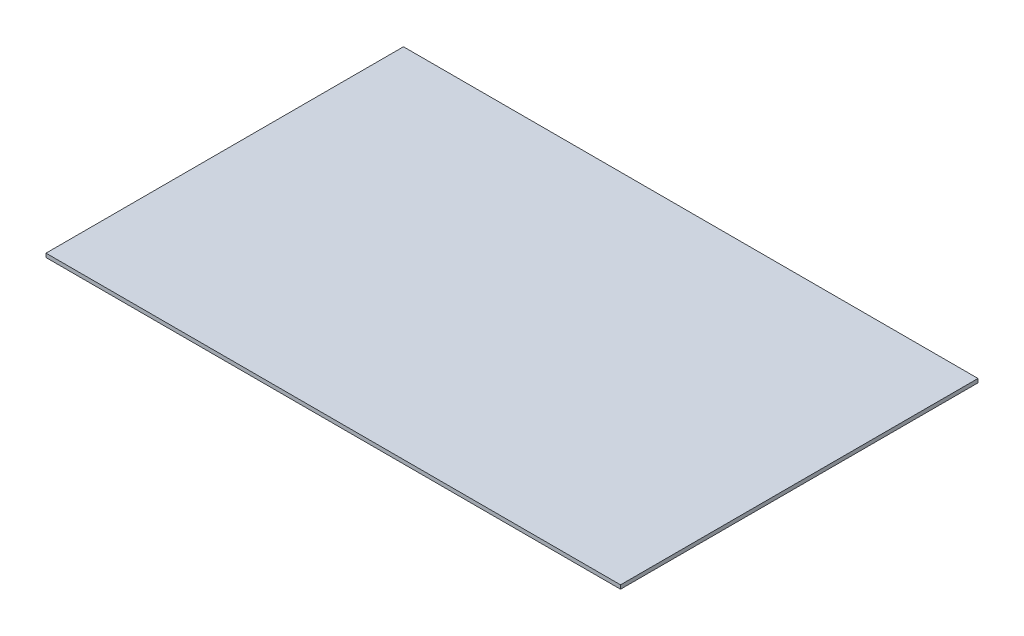
ISO-10303-21;
HEADER;
FILE_DESCRIPTION(('STEP AP214'),'2;1');
FILE_NAME('part.step','',(''),(''),'','','');
FILE_SCHEMA(('AUTOMOTIVE_DESIGN { 1 0 10303 214 1 1 1 1 }'));
ENDSEC;
DATA;
#1=APPLICATION_CONTEXT('core data for automotive mechanical design processes');
#2=APPLICATION_PROTOCOL_DEFINITION('international standard','automotive_design',2000,#1);
#3=PRODUCT_CONTEXT('',#1,'mechanical');
#4=PRODUCT('Part','Part','',(#3));
#5=PRODUCT_RELATED_PRODUCT_CATEGORY('part','',(#4));
#6=PRODUCT_DEFINITION_FORMATION('','',#4);
#7=PRODUCT_DEFINITION_CONTEXT('part definition',#1,'design');
#8=PRODUCT_DEFINITION('design','',#6,#7);
#9=PRODUCT_DEFINITION_SHAPE('','',#8);
#10=(LENGTH_UNIT() NAMED_UNIT(*) SI_UNIT(.MILLI.,.METRE.));
#11=(NAMED_UNIT(*) PLANE_ANGLE_UNIT() SI_UNIT($,.RADIAN.));
#12=(NAMED_UNIT(*) SI_UNIT($,.STERADIAN.) SOLID_ANGLE_UNIT());
#13=UNCERTAINTY_MEASURE_WITH_UNIT(LENGTH_MEASURE(1.E-05),#10,'distance_accuracy_value','');
#14=(GEOMETRIC_REPRESENTATION_CONTEXT(3) GLOBAL_UNCERTAINTY_ASSIGNED_CONTEXT((#13)) GLOBAL_UNIT_ASSIGNED_CONTEXT((#10,
#11,#12)) REPRESENTATION_CONTEXT('',''));
#15=CARTESIAN_POINT('',(0.,0.,0.));
#16=DIRECTION('',(0.,0.,1.));
#17=DIRECTION('',(1.,0.,0.));
#18=AXIS2_PLACEMENT_3D('',#15,#16,#17);
#19=CARTESIAN_POINT('',(225.,3.,140.));
#20=DIRECTION('',(-1.,0.,0.));
#21=DIRECTION('',(0.,0.,1.));
#22=AXIS2_PLACEMENT_3D('',#19,#20,#21);
#23=PLANE('',#22);
#24=DIRECTION('',(0.,0.,-1.));
#25=VECTOR('',#24,1.);
#26=CARTESIAN_POINT('',(225.,0.,140.));
#27=LINE('',#26,#25);
#28=CARTESIAN_POINT('',(225.,0.,140.));
#29=VERTEX_POINT('',#28);
#30=CARTESIAN_POINT('',(225.,0.,-140.));
#31=VERTEX_POINT('',#30);
#32=EDGE_CURVE('E96',#29,#31,#27,.T.);
#33=ORIENTED_EDGE('',*,*,#32,.T.);
#34=DIRECTION('',(0.,-1.,0.));
#35=VECTOR('',#34,1.);
#36=CARTESIAN_POINT('',(225.,3.,-140.));
#37=LINE('',#36,#35);
#38=CARTESIAN_POINT('',(225.,3.,-140.));
#39=VERTEX_POINT('',#38);
#40=EDGE_CURVE('E11',#39,#31,#37,.T.);
#41=ORIENTED_EDGE('',*,*,#40,.F.);
#42=DIRECTION('',(0.,0.,-1.));
#43=VECTOR('',#42,1.);
#44=CARTESIAN_POINT('',(225.,3.,140.));
#45=LINE('',#44,#43);
#46=CARTESIAN_POINT('',(225.,3.,140.));
#47=VERTEX_POINT('',#46);
#48=EDGE_CURVE('E84',#47,#39,#45,.T.);
#49=ORIENTED_EDGE('',*,*,#48,.F.);
#50=DIRECTION('',(0.,-1.,0.));
#51=VECTOR('',#50,1.);
#52=CARTESIAN_POINT('',(225.,3.,140.));
#53=LINE('',#52,#51);
#54=EDGE_CURVE('E92',#47,#29,#53,.T.);
#55=ORIENTED_EDGE('',*,*,#54,.T.);
#56=EDGE_LOOP('',(#33,#41,#49,#55));
#57=FACE_BOUND('',#56,.T.);
#58=ADVANCED_FACE('F33',(#57),#23,.F.);
#59=CARTESIAN_POINT('',(-225.,3.,-140.));
#60=DIRECTION('',(0.,0.,1.));
#61=DIRECTION('',(1.,0.,0.));
#62=AXIS2_PLACEMENT_3D('',#59,#60,#61);
#63=PLANE('',#62);
#64=DIRECTION('',(-1.,0.,0.));
#65=VECTOR('',#64,1.);
#66=CARTESIAN_POINT('',(-225.,0.,-140.));
#67=LINE('',#66,#65);
#68=CARTESIAN_POINT('',(-225.,0.,-140.));
#69=VERTEX_POINT('',#68);
#70=EDGE_CURVE('E88',#31,#69,#67,.T.);
#71=ORIENTED_EDGE('',*,*,#70,.T.);
#72=DIRECTION('',(0.,-1.,0.));
#73=VECTOR('',#72,1.);
#74=CARTESIAN_POINT('',(-225.,3.,-140.));
#75=LINE('',#74,#73);
#76=CARTESIAN_POINT('',(-225.,3.,-140.));
#77=VERTEX_POINT('',#76);
#78=EDGE_CURVE('E41',#77,#69,#75,.T.);
#79=ORIENTED_EDGE('',*,*,#78,.F.);
#80=DIRECTION('',(-1.,0.,0.));
#81=VECTOR('',#80,1.);
#82=CARTESIAN_POINT('',(-225.,3.,-140.));
#83=LINE('',#82,#81);
#84=EDGE_CURVE('E79',#39,#77,#83,.T.);
#85=ORIENTED_EDGE('',*,*,#84,.F.);
#86=ORIENTED_EDGE('',*,*,#40,.T.);
#87=EDGE_LOOP('',(#71,#79,#85,#86));
#88=FACE_BOUND('',#87,.T.);
#89=ADVANCED_FACE('F87',(#88),#63,.F.);
#90=CARTESIAN_POINT('',(-225.,3.,140.));
#91=DIRECTION('',(1.,0.,0.));
#92=DIRECTION('',(0.,0.,-1.));
#93=AXIS2_PLACEMENT_3D('',#90,#91,#92);
#94=PLANE('',#93);
#95=DIRECTION('',(0.,0.,1.));
#96=VECTOR('',#95,1.);
#97=CARTESIAN_POINT('',(-225.,0.,140.));
#98=LINE('',#97,#96);
#99=CARTESIAN_POINT('',(-225.,0.,140.));
#100=VERTEX_POINT('',#99);
#101=EDGE_CURVE('E66',#69,#100,#98,.T.);
#102=ORIENTED_EDGE('',*,*,#101,.T.);
#103=DIRECTION('',(0.,-1.,0.));
#104=VECTOR('',#103,1.);
#105=CARTESIAN_POINT('',(-225.,3.,140.));
#106=LINE('',#105,#104);
#107=CARTESIAN_POINT('',(-225.,3.,140.));
#108=VERTEX_POINT('',#107);
#109=EDGE_CURVE('E89',#108,#100,#106,.T.);
#110=ORIENTED_EDGE('',*,*,#109,.F.);
#111=DIRECTION('',(0.,0.,1.));
#112=VECTOR('',#111,1.);
#113=CARTESIAN_POINT('',(-225.,3.,140.));
#114=LINE('',#113,#112);
#115=EDGE_CURVE('E82',#77,#108,#114,.T.);
#116=ORIENTED_EDGE('',*,*,#115,.F.);
#117=ORIENTED_EDGE('',*,*,#78,.T.);
#118=EDGE_LOOP('',(#102,#110,#116,#117));
#119=FACE_BOUND('',#118,.T.);
#120=ADVANCED_FACE('F90',(#119),#94,.F.);
#121=CARTESIAN_POINT('',(-225.,3.,140.));
#122=DIRECTION('',(0.,0.,-1.));
#123=DIRECTION('',(-1.,0.,0.));
#124=AXIS2_PLACEMENT_3D('',#121,#122,#123);
#125=PLANE('',#124);
#126=DIRECTION('',(1.,0.,0.));
#127=VECTOR('',#126,1.);
#128=CARTESIAN_POINT('',(-225.,0.,140.));
#129=LINE('',#128,#127);
#130=EDGE_CURVE('E72',#100,#29,#129,.T.);
#131=ORIENTED_EDGE('',*,*,#130,.T.);
#132=ORIENTED_EDGE('',*,*,#54,.F.);
#133=DIRECTION('',(1.,0.,0.));
#134=VECTOR('',#133,1.);
#135=CARTESIAN_POINT('',(-225.,3.,140.));
#136=LINE('',#135,#134);
#137=EDGE_CURVE('E49',#108,#47,#136,.T.);
#138=ORIENTED_EDGE('',*,*,#137,.F.);
#139=ORIENTED_EDGE('',*,*,#109,.T.);
#140=EDGE_LOOP('',(#131,#132,#138,#139));
#141=FACE_BOUND('',#140,.T.);
#142=ADVANCED_FACE('F103',(#141),#125,.F.);
#143=CARTESIAN_POINT('',(0.,3.,0.));
#144=DIRECTION('',(0.,-1.,0.));
#145=DIRECTION('',(0.,0.,-1.));
#146=AXIS2_PLACEMENT_3D('',#143,#144,#145);
#147=PLANE('',#146);
#148=ORIENTED_EDGE('',*,*,#48,.T.);
#149=ORIENTED_EDGE('',*,*,#84,.T.);
#150=ORIENTED_EDGE('',*,*,#115,.T.);
#151=ORIENTED_EDGE('',*,*,#137,.T.);
#152=EDGE_LOOP('',(#148,#149,#150,#151));
#153=FACE_BOUND('',#152,.T.);
#154=ADVANCED_FACE('F80',(#153),#147,.F.);
#155=CARTESIAN_POINT('',(0.,0.,0.));
#156=DIRECTION('',(0.,-1.,0.));
#157=DIRECTION('',(0.,0.,-1.));
#158=AXIS2_PLACEMENT_3D('',#155,#156,#157);
#159=PLANE('',#158);
#160=ORIENTED_EDGE('',*,*,#32,.F.);
#161=ORIENTED_EDGE('',*,*,#130,.F.);
#162=ORIENTED_EDGE('',*,*,#101,.F.);
#163=ORIENTED_EDGE('',*,*,#70,.F.);
#164=EDGE_LOOP('',(#160,#161,#162,#163));
#165=FACE_BOUND('',#164,.T.);
#166=ADVANCED_FACE('F106',(#165),#159,.T.);
#167=CLOSED_SHELL('',(#58,#89,#120,#142,#154,#166));
#168=MANIFOLD_SOLID_BREP('B2',#167);
#169=ADVANCED_BREP_SHAPE_REPRESENTATION('',(#18,#168),#14);
#170=SHAPE_DEFINITION_REPRESENTATION(#9,#169);
ENDSEC;
END-ISO-10303-21;
